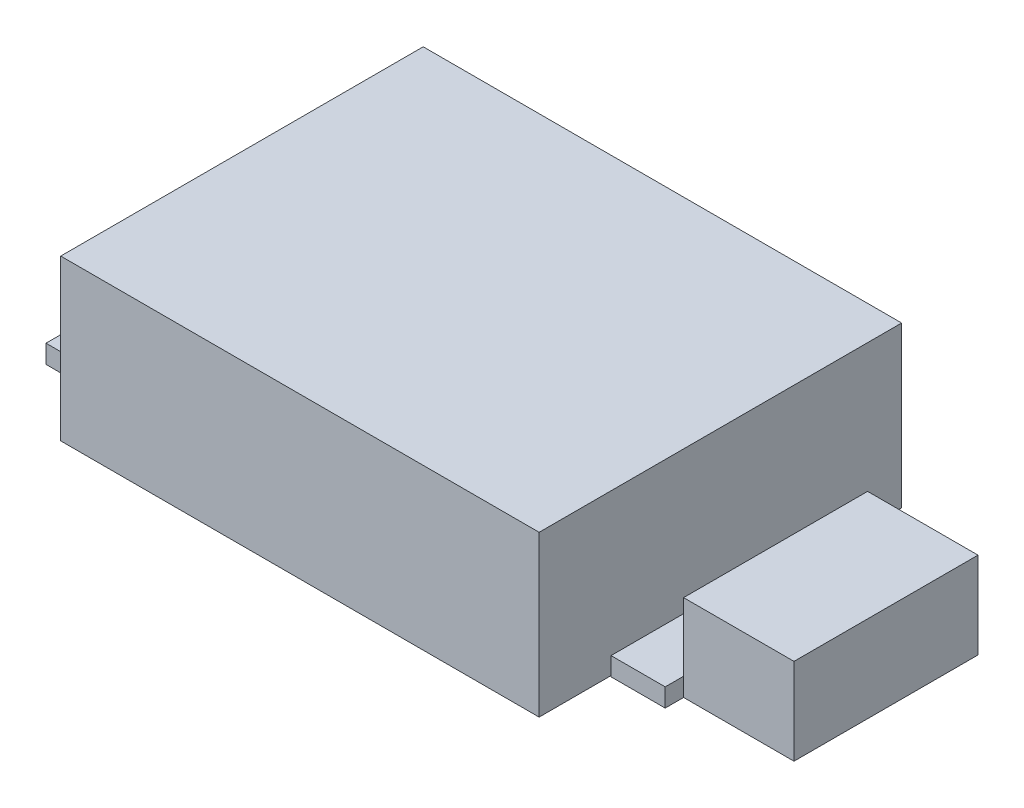
ISO-10303-21;
HEADER;
FILE_DESCRIPTION(('STEP AP214'),'2;1');
FILE_NAME('part.step','',(''),(''),'','','');
FILE_SCHEMA(('AUTOMOTIVE_DESIGN { 1 0 10303 214 1 1 1 1 }'));
ENDSEC;
DATA;
#1=APPLICATION_CONTEXT('core data for automotive mechanical design processes');
#2=APPLICATION_PROTOCOL_DEFINITION('international standard','automotive_design',2000,#1);
#3=PRODUCT_CONTEXT('',#1,'mechanical');
#4=PRODUCT('Part','Part','',(#3));
#5=PRODUCT_RELATED_PRODUCT_CATEGORY('part','',(#4));
#6=PRODUCT_DEFINITION_FORMATION('','',#4);
#7=PRODUCT_DEFINITION_CONTEXT('part definition',#1,'design');
#8=PRODUCT_DEFINITION('design','',#6,#7);
#9=PRODUCT_DEFINITION_SHAPE('','',#8);
#10=(LENGTH_UNIT() NAMED_UNIT(*) SI_UNIT(.MILLI.,.METRE.));
#11=(NAMED_UNIT(*) PLANE_ANGLE_UNIT() SI_UNIT($,.RADIAN.));
#12=(NAMED_UNIT(*) SI_UNIT($,.STERADIAN.) SOLID_ANGLE_UNIT());
#13=UNCERTAINTY_MEASURE_WITH_UNIT(LENGTH_MEASURE(1.E-05),#10,'distance_accuracy_value','');
#14=(GEOMETRIC_REPRESENTATION_CONTEXT(3) GLOBAL_UNCERTAINTY_ASSIGNED_CONTEXT((#13)) GLOBAL_UNIT_ASSIGNED_CONTEXT((#10,
#11,#12)) REPRESENTATION_CONTEXT('',''));
#15=CARTESIAN_POINT('',(0.,0.,0.));
#16=DIRECTION('',(0.,0.,1.));
#17=DIRECTION('',(1.,0.,0.));
#18=AXIS2_PLACEMENT_3D('',#15,#16,#17);
#19=CARTESIAN_POINT('',(16.,1.,0.));
#20=DIRECTION('',(1.,0.,0.));
#21=DIRECTION('',(0.,0.,-1.));
#22=AXIS2_PLACEMENT_3D('',#19,#20,#21);
#23=PLANE('',#22);
#24=DIRECTION('',(0.,0.,1.));
#25=VECTOR('',#24,1.);
#26=CARTESIAN_POINT('',(16.,1.,0.));
#27=LINE('',#26,#25);
#28=CARTESIAN_POINT('',(16.,1.,-6.00000000000001));
#29=VERTEX_POINT('',#28);
#30=CARTESIAN_POINT('',(16.,1.,-5.00000000000001));
#31=VERTEX_POINT('',#30);
#32=EDGE_CURVE('E174',#29,#31,#27,.T.);
#33=ORIENTED_EDGE('',*,*,#32,.T.);
#34=DIRECTION('',(0.,-1.,0.));
#35=VECTOR('',#34,1.);
#36=CARTESIAN_POINT('',(16.,4.7,-5.00000000000001));
#37=LINE('',#36,#35);
#38=CARTESIAN_POINT('',(16.,0.,-5.00000000000001));
#39=VERTEX_POINT('',#38);
#40=EDGE_CURVE('E58',#31,#39,#37,.T.);
#41=ORIENTED_EDGE('',*,*,#40,.T.);
#42=DIRECTION('',(0.,0.,1.));
#43=VECTOR('',#42,1.);
#44=CARTESIAN_POINT('',(16.,0.,0.));
#45=LINE('',#44,#43);
#46=CARTESIAN_POINT('',(16.,0.,-6.00000000000001));
#47=VERTEX_POINT('',#46);
#48=EDGE_CURVE('E168',#47,#39,#45,.T.);
#49=ORIENTED_EDGE('',*,*,#48,.F.);
#50=DIRECTION('',(0.,-1.,0.));
#51=VECTOR('',#50,1.);
#52=CARTESIAN_POINT('',(16.,1.,-6.00000000000001));
#53=LINE('',#52,#51);
#54=EDGE_CURVE('E76',#29,#47,#53,.T.);
#55=ORIENTED_EDGE('',*,*,#54,.F.);
#56=EDGE_LOOP('',(#33,#41,#49,#55));
#57=FACE_BOUND('',#56,.T.);
#58=ADVANCED_FACE('F49',(#57),#23,.T.);
#59=CARTESIAN_POINT('',(0.,1.,-6.00000000000001));
#60=DIRECTION('',(0.,0.,1.));
#61=DIRECTION('',(1.,0.,0.));
#62=AXIS2_PLACEMENT_3D('',#59,#60,#61);
#63=PLANE('',#62);
#64=DIRECTION('',(-1.,0.,0.));
#65=VECTOR('',#64,1.);
#66=CARTESIAN_POINT('',(0.,0.,-6.00000000000001));
#67=LINE('',#66,#65);
#68=CARTESIAN_POINT('',(13.057268722467,0.,-6.00000000000001));
#69=VERTEX_POINT('',#68);
#70=EDGE_CURVE('E138',#47,#69,#67,.T.);
#71=ORIENTED_EDGE('',*,*,#70,.T.);
#72=DIRECTION('',(0.,-1.,0.));
#73=VECTOR('',#72,1.);
#74=CARTESIAN_POINT('',(13.057268722467,1.,-6.00000000000001));
#75=LINE('',#74,#73);
#76=CARTESIAN_POINT('',(13.057268722467,1.,-6.00000000000001));
#77=VERTEX_POINT('',#76);
#78=EDGE_CURVE('E53',#77,#69,#75,.T.);
#79=ORIENTED_EDGE('',*,*,#78,.F.);
#80=DIRECTION('',(-1.,0.,0.));
#81=VECTOR('',#80,1.);
#82=CARTESIAN_POINT('',(0.,1.,-6.00000000000001));
#83=LINE('',#82,#81);
#84=EDGE_CURVE('E166',#29,#77,#83,.T.);
#85=ORIENTED_EDGE('',*,*,#84,.F.);
#86=ORIENTED_EDGE('',*,*,#54,.T.);
#87=EDGE_LOOP('',(#71,#79,#85,#86));
#88=FACE_BOUND('',#87,.T.);
#89=ADVANCED_FACE('F51',(#88),#63,.F.);
#90=CARTESIAN_POINT('',(13.057268722467,1.,0.));
#91=DIRECTION('',(1.,0.,0.));
#92=DIRECTION('',(0.,0.,-1.));
#93=AXIS2_PLACEMENT_3D('',#90,#91,#92);
#94=PLANE('',#93);
#95=DIRECTION('',(0.,0.,1.));
#96=VECTOR('',#95,1.);
#97=CARTESIAN_POINT('',(13.057268722467,0.,0.));
#98=LINE('',#97,#96);
#99=CARTESIAN_POINT('',(13.057268722467,0.,5.99999999999999));
#100=VERTEX_POINT('',#99);
#101=EDGE_CURVE('E178',#69,#100,#98,.T.);
#102=ORIENTED_EDGE('',*,*,#101,.T.);
#103=DIRECTION('',(0.,-1.,0.));
#104=VECTOR('',#103,1.);
#105=CARTESIAN_POINT('',(13.057268722467,1.,5.99999999999999));
#106=LINE('',#105,#104);
#107=CARTESIAN_POINT('',(13.057268722467,1.,5.99999999999999));
#108=VERTEX_POINT('',#107);
#109=EDGE_CURVE('E190',#108,#100,#106,.T.);
#110=ORIENTED_EDGE('',*,*,#109,.F.);
#111=DIRECTION('',(0.,0.,1.));
#112=VECTOR('',#111,1.);
#113=CARTESIAN_POINT('',(13.057268722467,1.,0.));
#114=LINE('',#113,#112);
#115=EDGE_CURVE('E103',#77,#108,#114,.T.);
#116=ORIENTED_EDGE('',*,*,#115,.F.);
#117=ORIENTED_EDGE('',*,*,#78,.T.);
#118=EDGE_LOOP('',(#102,#110,#116,#117));
#119=FACE_BOUND('',#118,.T.);
#120=ADVANCED_FACE('F208',(#119),#94,.F.);
#121=CARTESIAN_POINT('',(0.,1.,5.99999999999999));
#122=DIRECTION('',(0.,0.,1.));
#123=DIRECTION('',(1.,0.,0.));
#124=AXIS2_PLACEMENT_3D('',#121,#122,#123);
#125=PLANE('',#124);
#126=DIRECTION('',(-1.,0.,0.));
#127=VECTOR('',#126,1.);
#128=CARTESIAN_POINT('',(0.,0.,5.99999999999999));
#129=LINE('',#128,#127);
#130=CARTESIAN_POINT('',(16.,0.,5.99999999999999));
#131=VERTEX_POINT('',#130);
#132=EDGE_CURVE('E181',#131,#100,#129,.T.);
#133=ORIENTED_EDGE('',*,*,#132,.F.);
#134=DIRECTION('',(0.,-1.,0.));
#135=VECTOR('',#134,1.);
#136=CARTESIAN_POINT('',(16.,1.,5.99999999999999));
#137=LINE('',#136,#135);
#138=CARTESIAN_POINT('',(16.,1.,5.99999999999999));
#139=VERTEX_POINT('',#138);
#140=EDGE_CURVE('E188',#139,#131,#137,.T.);
#141=ORIENTED_EDGE('',*,*,#140,.F.);
#142=DIRECTION('',(-1.,0.,0.));
#143=VECTOR('',#142,1.);
#144=CARTESIAN_POINT('',(0.,1.,5.99999999999999));
#145=LINE('',#144,#143);
#146=EDGE_CURVE('E170',#139,#108,#145,.T.);
#147=ORIENTED_EDGE('',*,*,#146,.T.);
#148=ORIENTED_EDGE('',*,*,#109,.T.);
#149=EDGE_LOOP('',(#133,#141,#147,#148));
#150=FACE_BOUND('',#149,.T.);
#151=ADVANCED_FACE('F207',(#150),#125,.T.);
#152=DIRECTION('',(0.,-1.,0.));
#153=VECTOR('',#152,1.);
#154=CARTESIAN_POINT('',(16.,4.7,4.99999999999999));
#155=LINE('',#154,#153);
#156=CARTESIAN_POINT('',(16.,1.,4.99999999999999));
#157=VERTEX_POINT('',#156);
#158=CARTESIAN_POINT('',(16.,0.,4.99999999999999));
#159=VERTEX_POINT('',#158);
#160=EDGE_CURVE('E12',#157,#159,#155,.T.);
#161=ORIENTED_EDGE('',*,*,#160,.F.);
#162=EDGE_CURVE('E173',#157,#139,#27,.T.);
#163=ORIENTED_EDGE('',*,*,#162,.T.);
#164=ORIENTED_EDGE('',*,*,#140,.T.);
#165=EDGE_CURVE('E184',#159,#131,#45,.T.);
#166=ORIENTED_EDGE('',*,*,#165,.F.);
#167=EDGE_LOOP('',(#161,#163,#164,#166));
#168=FACE_BOUND('',#167,.T.);
#169=ADVANCED_FACE('F205',(#168),#23,.T.);
#170=CARTESIAN_POINT('',(0.,1.,0.));
#171=DIRECTION('',(0.,1.,0.));
#172=DIRECTION('',(0.,0.,1.));
#173=AXIS2_PLACEMENT_3D('',#170,#171,#172);
#174=PLANE('',#173);
#175=ORIENTED_EDGE('',*,*,#84,.T.);
#176=ORIENTED_EDGE('',*,*,#115,.T.);
#177=ORIENTED_EDGE('',*,*,#146,.F.);
#178=ORIENTED_EDGE('',*,*,#162,.F.);
#179=EDGE_CURVE('E176',#31,#157,#27,.T.);
#180=ORIENTED_EDGE('',*,*,#179,.F.);
#181=ORIENTED_EDGE('',*,*,#32,.F.);
#182=EDGE_LOOP('',(#175,#176,#177,#178,#180,#181));
#183=FACE_BOUND('',#182,.T.);
#184=ADVANCED_FACE('F199',(#183),#174,.T.);
#185=CARTESIAN_POINT('',(0.,0.,0.));
#186=DIRECTION('',(0.,1.,0.));
#187=DIRECTION('',(0.,0.,1.));
#188=AXIS2_PLACEMENT_3D('',#185,#186,#187);
#189=PLANE('',#188);
#190=ORIENTED_EDGE('',*,*,#70,.F.);
#191=ORIENTED_EDGE('',*,*,#48,.T.);
#192=DIRECTION('',(1.,0.,0.));
#193=VECTOR('',#192,1.);
#194=CARTESIAN_POINT('',(0.,0.,-5.00000000000001));
#195=LINE('',#194,#193);
#196=CARTESIAN_POINT('',(22.,0.,-5.));
#197=VERTEX_POINT('',#196);
#198=EDGE_CURVE('E67',#39,#197,#195,.T.);
#199=ORIENTED_EDGE('',*,*,#198,.T.);
#200=DIRECTION('',(0.,0.,1.));
#201=VECTOR('',#200,1.);
#202=CARTESIAN_POINT('',(22.,0.,0.));
#203=LINE('',#202,#201);
#204=CARTESIAN_POINT('',(22.,0.,4.99999999999999));
#205=VERTEX_POINT('',#204);
#206=EDGE_CURVE('E151',#197,#205,#203,.T.);
#207=ORIENTED_EDGE('',*,*,#206,.T.);
#208=DIRECTION('',(1.,0.,0.));
#209=VECTOR('',#208,1.);
#210=CARTESIAN_POINT('',(0.,0.,5.));
#211=LINE('',#210,#209);
#212=EDGE_CURVE('E154',#159,#205,#211,.T.);
#213=ORIENTED_EDGE('',*,*,#212,.F.);
#214=ORIENTED_EDGE('',*,*,#165,.T.);
#215=ORIENTED_EDGE('',*,*,#132,.T.);
#216=ORIENTED_EDGE('',*,*,#101,.F.);
#217=EDGE_LOOP('',(#190,#191,#199,#207,#213,#214,#215,#216));
#218=FACE_BOUND('',#217,.T.);
#219=ADVANCED_FACE('F196',(#218),#189,.F.);
#220=CARTESIAN_POINT('',(16.,4.7,0.));
#221=DIRECTION('',(1.,0.,0.));
#222=DIRECTION('',(0.,0.,-1.));
#223=AXIS2_PLACEMENT_3D('',#220,#221,#222);
#224=PLANE('',#223);
#225=CARTESIAN_POINT('',(16.,4.7,-5.00000000000001));
#226=VERTEX_POINT('',#225);
#227=EDGE_CURVE('E130',#226,#31,#37,.T.);
#228=ORIENTED_EDGE('',*,*,#227,.T.);
#229=ORIENTED_EDGE('',*,*,#179,.T.);
#230=CARTESIAN_POINT('',(16.,4.7,4.99999999999999));
#231=VERTEX_POINT('',#230);
#232=EDGE_CURVE('E60',#231,#157,#155,.T.);
#233=ORIENTED_EDGE('',*,*,#232,.F.);
#234=DIRECTION('',(0.,0.,1.));
#235=VECTOR('',#234,1.);
#236=CARTESIAN_POINT('',(16.,4.7,0.));
#237=LINE('',#236,#235);
#238=EDGE_CURVE('E141',#226,#231,#237,.T.);
#239=ORIENTED_EDGE('',*,*,#238,.F.);
#240=EDGE_LOOP('',(#228,#229,#233,#239));
#241=FACE_BOUND('',#240,.T.);
#242=ADVANCED_FACE('F142',(#241),#224,.F.);
#243=CARTESIAN_POINT('',(0.,4.7,-5.00000000000001));
#244=DIRECTION('',(0.,0.,-1.));
#245=DIRECTION('',(-1.,0.,0.));
#246=AXIS2_PLACEMENT_3D('',#243,#244,#245);
#247=PLANE('',#246);
#248=ORIENTED_EDGE('',*,*,#198,.F.);
#249=ORIENTED_EDGE('',*,*,#40,.F.);
#250=ORIENTED_EDGE('',*,*,#227,.F.);
#251=DIRECTION('',(1.,0.,0.));
#252=VECTOR('',#251,1.);
#253=CARTESIAN_POINT('',(0.,4.7,-5.00000000000001));
#254=LINE('',#253,#252);
#255=CARTESIAN_POINT('',(22.,4.7,-5.));
#256=VERTEX_POINT('',#255);
#257=EDGE_CURVE('E134',#226,#256,#254,.T.);
#258=ORIENTED_EDGE('',*,*,#257,.T.);
#259=DIRECTION('',(0.,-1.,0.));
#260=VECTOR('',#259,1.);
#261=CARTESIAN_POINT('',(22.,4.7,-5.));
#262=LINE('',#261,#260);
#263=EDGE_CURVE('E159',#256,#197,#262,.T.);
#264=ORIENTED_EDGE('',*,*,#263,.T.);
#265=EDGE_LOOP('',(#248,#249,#250,#258,#264));
#266=FACE_BOUND('',#265,.T.);
#267=ADVANCED_FACE('F132',(#266),#247,.T.);
#268=CARTESIAN_POINT('',(0.,4.7,5.));
#269=DIRECTION('',(0.,0.,-1.));
#270=DIRECTION('',(-1.,0.,0.));
#271=AXIS2_PLACEMENT_3D('',#268,#269,#270);
#272=PLANE('',#271);
#273=ORIENTED_EDGE('',*,*,#212,.T.);
#274=DIRECTION('',(0.,-1.,0.));
#275=VECTOR('',#274,1.);
#276=CARTESIAN_POINT('',(22.,4.7,4.99999999999999));
#277=LINE('',#276,#275);
#278=CARTESIAN_POINT('',(22.,4.7,4.99999999999999));
#279=VERTEX_POINT('',#278);
#280=EDGE_CURVE('E164',#279,#205,#277,.T.);
#281=ORIENTED_EDGE('',*,*,#280,.F.);
#282=DIRECTION('',(1.,0.,0.));
#283=VECTOR('',#282,1.);
#284=CARTESIAN_POINT('',(0.,4.7,5.));
#285=LINE('',#284,#283);
#286=EDGE_CURVE('E146',#231,#279,#285,.T.);
#287=ORIENTED_EDGE('',*,*,#286,.F.);
#288=ORIENTED_EDGE('',*,*,#232,.T.);
#289=ORIENTED_EDGE('',*,*,#160,.T.);
#290=EDGE_LOOP('',(#273,#281,#287,#288,#289));
#291=FACE_BOUND('',#290,.T.);
#292=ADVANCED_FACE('F212',(#291),#272,.F.);
#293=CARTESIAN_POINT('',(22.,4.7,0.));
#294=DIRECTION('',(1.,0.,0.));
#295=DIRECTION('',(0.,0.,-1.));
#296=AXIS2_PLACEMENT_3D('',#293,#294,#295);
#297=PLANE('',#296);
#298=ORIENTED_EDGE('',*,*,#206,.F.);
#299=ORIENTED_EDGE('',*,*,#263,.F.);
#300=DIRECTION('',(0.,0.,1.));
#301=VECTOR('',#300,1.);
#302=CARTESIAN_POINT('',(22.,4.7,0.));
#303=LINE('',#302,#301);
#304=EDGE_CURVE('E150',#256,#279,#303,.T.);
#305=ORIENTED_EDGE('',*,*,#304,.T.);
#306=ORIENTED_EDGE('',*,*,#280,.T.);
#307=EDGE_LOOP('',(#298,#299,#305,#306));
#308=FACE_BOUND('',#307,.T.);
#309=ADVANCED_FACE('F214',(#308),#297,.T.);
#310=CARTESIAN_POINT('',(0.,4.7,0.));
#311=DIRECTION('',(0.,1.,0.));
#312=DIRECTION('',(0.,0.,1.));
#313=AXIS2_PLACEMENT_3D('',#310,#311,#312);
#314=PLANE('',#313);
#315=ORIENTED_EDGE('',*,*,#257,.F.);
#316=ORIENTED_EDGE('',*,*,#238,.T.);
#317=ORIENTED_EDGE('',*,*,#286,.T.);
#318=ORIENTED_EDGE('',*,*,#304,.F.);
#319=EDGE_LOOP('',(#315,#316,#317,#318));
#320=FACE_BOUND('',#319,.T.);
#321=ADVANCED_FACE('F148',(#320),#314,.T.);
#322=CLOSED_SHELL('',(#58,#89,#120,#151,#169,#184,#219,#242,#267,#292,#309,#321));
#323=MANIFOLD_SOLID_BREP('B2',#322);
#324=CARTESIAN_POINT('',(-17.,1.,0.));
#325=DIRECTION('',(-1.,0.,0.));
#326=DIRECTION('',(0.,0.,1.));
#327=AXIS2_PLACEMENT_3D('',#324,#325,#326);
#328=PLANE('',#327);
#329=DIRECTION('',(0.,0.,-1.));
#330=VECTOR('',#329,1.);
#331=CARTESIAN_POINT('',(-17.,0.,0.));
#332=LINE('',#331,#330);
#333=CARTESIAN_POINT('',(-17.,0.,6.65));
#334=VERTEX_POINT('',#333);
#335=CARTESIAN_POINT('',(-17.,0.,-6.65));
#336=VERTEX_POINT('',#335);
#337=EDGE_CURVE('E430',#334,#336,#332,.T.);
#338=ORIENTED_EDGE('',*,*,#337,.F.);
#339=DIRECTION('',(0.,-1.,0.));
#340=VECTOR('',#339,1.);
#341=CARTESIAN_POINT('',(-17.,1.,6.65));
#342=LINE('',#341,#340);
#343=CARTESIAN_POINT('',(-17.,1.,6.65));
#344=VERTEX_POINT('',#343);
#345=EDGE_CURVE('E47',#344,#334,#342,.T.);
#346=ORIENTED_EDGE('',*,*,#345,.F.);
#347=DIRECTION('',(0.,0.,-1.));
#348=VECTOR('',#347,1.);
#349=CARTESIAN_POINT('',(-17.,1.,0.));
#350=LINE('',#349,#348);
#351=CARTESIAN_POINT('',(-17.,1.,-6.65));
#352=VERTEX_POINT('',#351);
#353=EDGE_CURVE('E439',#344,#352,#350,.T.);
#354=ORIENTED_EDGE('',*,*,#353,.T.);
#355=DIRECTION('',(0.,-1.,0.));
#356=VECTOR('',#355,1.);
#357=CARTESIAN_POINT('',(-17.,1.,-6.65));
#358=LINE('',#357,#356);
#359=EDGE_CURVE('E371',#352,#336,#358,.T.);
#360=ORIENTED_EDGE('',*,*,#359,.T.);
#361=EDGE_LOOP('',(#338,#346,#354,#360));
#362=FACE_BOUND('',#361,.T.);
#363=ADVANCED_FACE('F335',(#362),#328,.T.);
#364=CARTESIAN_POINT('',(0.,1.,6.65000000000001));
#365=DIRECTION('',(0.,0.,1.));
#366=DIRECTION('',(1.,0.,0.));
#367=AXIS2_PLACEMENT_3D('',#364,#365,#366);
#368=PLANE('',#367);
#369=DIRECTION('',(-1.,0.,0.));
#370=VECTOR('',#369,1.);
#371=CARTESIAN_POINT('',(0.,0.,6.65000000000001));
#372=LINE('',#371,#370);
#373=CARTESIAN_POINT('',(-13.,0.,6.65));
#374=VERTEX_POINT('',#373);
#375=EDGE_CURVE('E433',#374,#334,#372,.T.);
#376=ORIENTED_EDGE('',*,*,#375,.F.);
#377=DIRECTION('',(0.,-1.,0.));
#378=VECTOR('',#377,1.);
#379=CARTESIAN_POINT('',(-13.,1.,6.65));
#380=LINE('',#379,#378);
#381=CARTESIAN_POINT('',(-13.,1.,6.65));
#382=VERTEX_POINT('',#381);
#383=EDGE_CURVE('E343',#382,#374,#380,.T.);
#384=ORIENTED_EDGE('',*,*,#383,.F.);
#385=DIRECTION('',(-1.,0.,0.));
#386=VECTOR('',#385,1.);
#387=CARTESIAN_POINT('',(0.,1.,6.65000000000001));
#388=LINE('',#387,#386);
#389=EDGE_CURVE('E441',#382,#344,#388,.T.);
#390=ORIENTED_EDGE('',*,*,#389,.T.);
#391=ORIENTED_EDGE('',*,*,#345,.T.);
#392=EDGE_LOOP('',(#376,#384,#390,#391));
#393=FACE_BOUND('',#392,.T.);
#394=ADVANCED_FACE('F479',(#393),#368,.T.);
#395=CARTESIAN_POINT('',(0.,1.,-6.64999999999999));
#396=DIRECTION('',(0.,0.,1.));
#397=DIRECTION('',(1.,0.,0.));
#398=AXIS2_PLACEMENT_3D('',#395,#396,#397);
#399=PLANE('',#398);
#400=DIRECTION('',(-1.,0.,0.));
#401=VECTOR('',#400,1.);
#402=CARTESIAN_POINT('',(0.,0.,-6.64999999999999));
#403=LINE('',#402,#401);
#404=CARTESIAN_POINT('',(-13.,0.,-6.65));
#405=VERTEX_POINT('',#404);
#406=EDGE_CURVE('E442',#405,#336,#403,.T.);
#407=ORIENTED_EDGE('',*,*,#406,.T.);
#408=ORIENTED_EDGE('',*,*,#359,.F.);
#409=DIRECTION('',(-1.,0.,0.));
#410=VECTOR('',#409,1.);
#411=CARTESIAN_POINT('',(0.,1.,-6.64999999999999));
#412=LINE('',#411,#410);
#413=CARTESIAN_POINT('',(-13.,1.,-6.65));
#414=VERTEX_POINT('',#413);
#415=EDGE_CURVE('E351',#414,#352,#412,.T.);
#416=ORIENTED_EDGE('',*,*,#415,.F.);
#417=DIRECTION('',(0.,-1.,0.));
#418=VECTOR('',#417,1.);
#419=CARTESIAN_POINT('',(-13.,1.,-6.65));
#420=LINE('',#419,#418);
#421=EDGE_CURVE('E364',#414,#405,#420,.T.);
#422=ORIENTED_EDGE('',*,*,#421,.T.);
#423=EDGE_LOOP('',(#407,#408,#416,#422));
#424=FACE_BOUND('',#423,.T.);
#425=ADVANCED_FACE('F477',(#424),#399,.F.);
#426=CARTESIAN_POINT('',(0.,1.,0.));
#427=DIRECTION('',(0.,1.,0.));
#428=DIRECTION('',(0.,0.,1.));
#429=AXIS2_PLACEMENT_3D('',#426,#427,#428);
#430=PLANE('',#429);
#431=ORIENTED_EDGE('',*,*,#353,.F.);
#432=ORIENTED_EDGE('',*,*,#389,.F.);
#433=DIRECTION('',(0.,0.,1.));
#434=VECTOR('',#433,1.);
#435=CARTESIAN_POINT('',(-13.,1.,0.));
#436=LINE('',#435,#434);
#437=EDGE_CURVE('E445',#414,#382,#436,.T.);
#438=ORIENTED_EDGE('',*,*,#437,.F.);
#439=ORIENTED_EDGE('',*,*,#415,.T.);
#440=EDGE_LOOP('',(#431,#432,#438,#439));
#441=FACE_BOUND('',#440,.T.);
#442=ADVANCED_FACE('F478',(#441),#430,.T.);
#443=CARTESIAN_POINT('',(0.,0.,0.));
#444=DIRECTION('',(0.,1.,0.));
#445=DIRECTION('',(0.,0.,1.));
#446=AXIS2_PLACEMENT_3D('',#443,#444,#445);
#447=PLANE('',#446);
#448=ORIENTED_EDGE('',*,*,#337,.T.);
#449=ORIENTED_EDGE('',*,*,#406,.F.);
#450=DIRECTION('',(0.,0.,1.));
#451=VECTOR('',#450,1.);
#452=CARTESIAN_POINT('',(-13.,0.,0.));
#453=LINE('',#452,#451);
#454=CARTESIAN_POINT('',(-13.,0.,-9.85));
#455=VERTEX_POINT('',#454);
#456=EDGE_CURVE('E464',#455,#405,#453,.T.);
#457=ORIENTED_EDGE('',*,*,#456,.F.);
#458=DIRECTION('',(-1.,0.,0.));
#459=VECTOR('',#458,1.);
#460=CARTESIAN_POINT('',(0.,0.,-9.85));
#461=LINE('',#460,#459);
#462=CARTESIAN_POINT('',(13.,0.,-9.85));
#463=VERTEX_POINT('',#462);
#464=EDGE_CURVE('E429',#463,#455,#461,.T.);
#465=ORIENTED_EDGE('',*,*,#464,.F.);
#466=DIRECTION('',(0.,0.,1.));
#467=VECTOR('',#466,1.);
#468=CARTESIAN_POINT('',(13.,0.,0.));
#469=LINE('',#468,#467);
#470=CARTESIAN_POINT('',(13.,0.,9.84999999999999));
#471=VERTEX_POINT('',#470);
#472=EDGE_CURVE('E425',#463,#471,#469,.T.);
#473=ORIENTED_EDGE('',*,*,#472,.T.);
#474=DIRECTION('',(-1.,0.,0.));
#475=VECTOR('',#474,1.);
#476=CARTESIAN_POINT('',(0.,0.,9.85));
#477=LINE('',#476,#475);
#478=CARTESIAN_POINT('',(-13.,0.,9.85));
#479=VERTEX_POINT('',#478);
#480=EDGE_CURVE('E463',#471,#479,#477,.T.);
#481=ORIENTED_EDGE('',*,*,#480,.T.);
#482=EDGE_CURVE('E455',#374,#479,#453,.T.);
#483=ORIENTED_EDGE('',*,*,#482,.F.);
#484=ORIENTED_EDGE('',*,*,#375,.T.);
#485=EDGE_LOOP('',(#448,#449,#457,#465,#473,#481,#483,#484));
#486=FACE_BOUND('',#485,.T.);
#487=ADVANCED_FACE('F460',(#486),#447,.F.);
#488=CARTESIAN_POINT('',(0.,8.7,-9.85));
#489=DIRECTION('',(0.,0.,1.));
#490=DIRECTION('',(1.,0.,0.));
#491=AXIS2_PLACEMENT_3D('',#488,#489,#490);
#492=PLANE('',#491);
#493=ORIENTED_EDGE('',*,*,#464,.T.);
#494=DIRECTION('',(0.,-1.,0.));
#495=VECTOR('',#494,1.);
#496=CARTESIAN_POINT('',(-13.,8.7,-9.85));
#497=LINE('',#496,#495);
#498=CARTESIAN_POINT('',(-13.,8.7,-9.85));
#499=VERTEX_POINT('',#498);
#500=EDGE_CURVE('E409',#499,#455,#497,.T.);
#501=ORIENTED_EDGE('',*,*,#500,.F.);
#502=DIRECTION('',(-1.,0.,0.));
#503=VECTOR('',#502,1.);
#504=CARTESIAN_POINT('',(0.,8.7,-9.85));
#505=LINE('',#504,#503);
#506=CARTESIAN_POINT('',(13.,8.7,-9.85));
#507=VERTEX_POINT('',#506);
#508=EDGE_CURVE('E417',#507,#499,#505,.T.);
#509=ORIENTED_EDGE('',*,*,#508,.F.);
#510=DIRECTION('',(0.,-1.,0.));
#511=VECTOR('',#510,1.);
#512=CARTESIAN_POINT('',(13.,8.7,-9.85));
#513=LINE('',#512,#511);
#514=EDGE_CURVE('E471',#507,#463,#513,.T.);
#515=ORIENTED_EDGE('',*,*,#514,.T.);
#516=EDGE_LOOP('',(#493,#501,#509,#515));
#517=FACE_BOUND('',#516,.T.);
#518=ADVANCED_FACE('F427',(#517),#492,.F.);
#519=CARTESIAN_POINT('',(-13.,8.7,0.));
#520=DIRECTION('',(1.,0.,0.));
#521=DIRECTION('',(0.,0.,-1.));
#522=AXIS2_PLACEMENT_3D('',#519,#520,#521);
#523=PLANE('',#522);
#524=ORIENTED_EDGE('',*,*,#421,.F.);
#525=ORIENTED_EDGE('',*,*,#437,.T.);
#526=ORIENTED_EDGE('',*,*,#383,.T.);
#527=ORIENTED_EDGE('',*,*,#482,.T.);
#528=DIRECTION('',(0.,-1.,0.));
#529=VECTOR('',#528,1.);
#530=CARTESIAN_POINT('',(-13.,8.7,9.85));
#531=LINE('',#530,#529);
#532=CARTESIAN_POINT('',(-13.,8.7,9.85));
#533=VERTEX_POINT('',#532);
#534=EDGE_CURVE('E412',#533,#479,#531,.T.);
#535=ORIENTED_EDGE('',*,*,#534,.F.);
#536=DIRECTION('',(0.,0.,1.));
#537=VECTOR('',#536,1.);
#538=CARTESIAN_POINT('',(-13.,8.7,0.));
#539=LINE('',#538,#537);
#540=EDGE_CURVE('E404',#499,#533,#539,.T.);
#541=ORIENTED_EDGE('',*,*,#540,.F.);
#542=ORIENTED_EDGE('',*,*,#500,.T.);
#543=ORIENTED_EDGE('',*,*,#456,.T.);
#544=EDGE_LOOP('',(#524,#525,#526,#527,#535,#541,#542,#543));
#545=FACE_BOUND('',#544,.T.);
#546=ADVANCED_FACE('F406',(#545),#523,.F.);
#547=CARTESIAN_POINT('',(0.,8.7,9.85));
#548=DIRECTION('',(0.,0.,1.));
#549=DIRECTION('',(1.,0.,0.));
#550=AXIS2_PLACEMENT_3D('',#547,#548,#549);
#551=PLANE('',#550);
#552=ORIENTED_EDGE('',*,*,#480,.F.);
#553=DIRECTION('',(0.,-1.,0.));
#554=VECTOR('',#553,1.);
#555=CARTESIAN_POINT('',(13.,8.7,9.84999999999999));
#556=LINE('',#555,#554);
#557=CARTESIAN_POINT('',(13.,8.7,9.84999999999999));
#558=VERTEX_POINT('',#557);
#559=EDGE_CURVE('E435',#558,#471,#556,.T.);
#560=ORIENTED_EDGE('',*,*,#559,.F.);
#561=DIRECTION('',(-1.,0.,0.));
#562=VECTOR('',#561,1.);
#563=CARTESIAN_POINT('',(0.,8.7,9.85));
#564=LINE('',#563,#562);
#565=EDGE_CURVE('E416',#558,#533,#564,.T.);
#566=ORIENTED_EDGE('',*,*,#565,.T.);
#567=ORIENTED_EDGE('',*,*,#534,.T.);
#568=EDGE_LOOP('',(#552,#560,#566,#567));
#569=FACE_BOUND('',#568,.T.);
#570=ADVANCED_FACE('F476',(#569),#551,.T.);
#571=CARTESIAN_POINT('',(13.,8.7,0.));
#572=DIRECTION('',(1.,0.,0.));
#573=DIRECTION('',(0.,0.,-1.));
#574=AXIS2_PLACEMENT_3D('',#571,#572,#573);
#575=PLANE('',#574);
#576=ORIENTED_EDGE('',*,*,#472,.F.);
#577=ORIENTED_EDGE('',*,*,#514,.F.);
#578=DIRECTION('',(0.,0.,1.));
#579=VECTOR('',#578,1.);
#580=CARTESIAN_POINT('',(13.,8.7,0.));
#581=LINE('',#580,#579);
#582=EDGE_CURVE('E423',#507,#558,#581,.T.);
#583=ORIENTED_EDGE('',*,*,#582,.T.);
#584=ORIENTED_EDGE('',*,*,#559,.T.);
#585=EDGE_LOOP('',(#576,#577,#583,#584));
#586=FACE_BOUND('',#585,.T.);
#587=ADVANCED_FACE('F474',(#586),#575,.T.);
#588=CARTESIAN_POINT('',(0.,8.7,0.));
#589=DIRECTION('',(0.,1.,0.));
#590=DIRECTION('',(0.,0.,1.));
#591=AXIS2_PLACEMENT_3D('',#588,#589,#590);
#592=PLANE('',#591);
#593=ORIENTED_EDGE('',*,*,#508,.T.);
#594=ORIENTED_EDGE('',*,*,#540,.T.);
#595=ORIENTED_EDGE('',*,*,#565,.F.);
#596=ORIENTED_EDGE('',*,*,#582,.F.);
#597=EDGE_LOOP('',(#593,#594,#595,#596));
#598=FACE_BOUND('',#597,.T.);
#599=ADVANCED_FACE('F421',(#598),#592,.T.);
#600=CLOSED_SHELL('',(#363,#394,#425,#442,#487,#518,#546,#570,#587,#599));
#601=MANIFOLD_SOLID_BREP('B6',#600);
#602=ADVANCED_BREP_SHAPE_REPRESENTATION('',(#18,#323,#601),#14);
#603=SHAPE_DEFINITION_REPRESENTATION(#9,#602);
ENDSEC;
END-ISO-10303-21;
